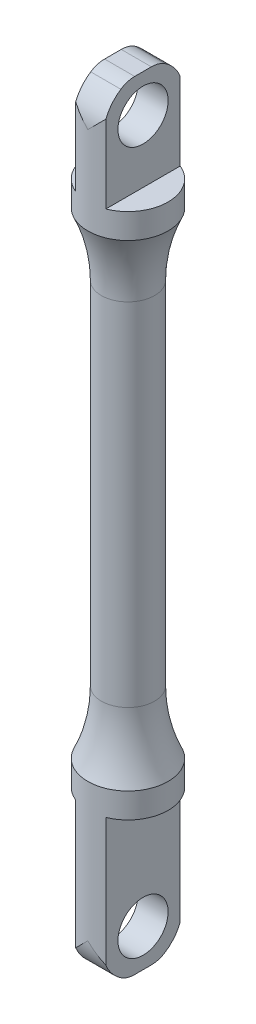
ISO-10303-21;
HEADER;
FILE_DESCRIPTION(('STEP AP214'),'2;1');
FILE_NAME('part.step','',(''),(''),'','','');
FILE_SCHEMA(('AUTOMOTIVE_DESIGN { 1 0 10303 214 1 1 1 1 }'));
ENDSEC;
DATA;
#1=APPLICATION_CONTEXT('core data for automotive mechanical design processes');
#2=APPLICATION_PROTOCOL_DEFINITION('international standard','automotive_design',2000,#1);
#3=PRODUCT_CONTEXT('',#1,'mechanical');
#4=PRODUCT('Part','Part','',(#3));
#5=PRODUCT_RELATED_PRODUCT_CATEGORY('part','',(#4));
#6=PRODUCT_DEFINITION_FORMATION('','',#4);
#7=PRODUCT_DEFINITION_CONTEXT('part definition',#1,'design');
#8=PRODUCT_DEFINITION('design','',#6,#7);
#9=PRODUCT_DEFINITION_SHAPE('','',#8);
#10=(LENGTH_UNIT() NAMED_UNIT(*) SI_UNIT(.MILLI.,.METRE.));
#11=(NAMED_UNIT(*) PLANE_ANGLE_UNIT() SI_UNIT($,.RADIAN.));
#12=(NAMED_UNIT(*) SI_UNIT($,.STERADIAN.) SOLID_ANGLE_UNIT());
#13=UNCERTAINTY_MEASURE_WITH_UNIT(LENGTH_MEASURE(1.E-05),#10,'distance_accuracy_value','');
#14=(GEOMETRIC_REPRESENTATION_CONTEXT(3) GLOBAL_UNCERTAINTY_ASSIGNED_CONTEXT((#13)) GLOBAL_UNIT_ASSIGNED_CONTEXT((#10,
#11,#12)) REPRESENTATION_CONTEXT('',''));
#15=CARTESIAN_POINT('',(0.,0.,0.));
#16=DIRECTION('',(0.,0.,1.));
#17=DIRECTION('',(1.,0.,0.));
#18=AXIS2_PLACEMENT_3D('',#15,#16,#17);
#19=CARTESIAN_POINT('',(3.00000000000001,-82.5,7.41619848709566));
#20=DIRECTION('',(-1.,0.,0.));
#21=DIRECTION('',(0.,-1.,0.));
#22=AXIS2_PLACEMENT_3D('',#19,#20,#21);
#23=PLANE('',#22);
#24=DIRECTION('',(0.,0.,1.));
#25=VECTOR('',#24,1.);
#26=CARTESIAN_POINT('',(3.00000000000001,-82.5,7.41619848709566));
#27=LINE('',#26,#25);
#28=CARTESIAN_POINT('',(3.00000000000001,-82.5,-1.65831239517774));
#29=VERTEX_POINT('',#28);
#30=CARTESIAN_POINT('',(3.00000000000001,-82.5,1.65831239517774));
#31=VERTEX_POINT('',#30);
#32=EDGE_CURVE('E311',#29,#31,#27,.T.);
#33=ORIENTED_EDGE('',*,*,#32,.F.);
#34=CARTESIAN_POINT('',(3.00000000000001,-77.5,-1.65831239517774));
#35=DIRECTION('',(-1.,0.,0.));
#36=DIRECTION('',(0.,-1.,0.));
#37=AXIS2_PLACEMENT_3D('',#34,#35,#36);
#38=CIRCLE('',#37,5.);
#39=CARTESIAN_POINT('',(3.00000000000001,-81.6666666666666,-4.42216638714064));
#40=VERTEX_POINT('',#39);
#41=EDGE_CURVE('E305',#29,#40,#38,.F.);
#42=ORIENTED_EDGE('',*,*,#41,.T.);
#43=CARTESIAN_POINT('',(3.00000000000001,-75.,0.));
#44=DIRECTION('',(-1.,0.,0.));
#45=DIRECTION('',(0.,-1.,0.));
#46=AXIS2_PLACEMENT_3D('',#43,#44,#45);
#47=CIRCLE('',#46,8.);
#48=CARTESIAN_POINT('',(3.00000000000001,-78.,-7.41619848709566));
#49=VERTEX_POINT('',#48);
#50=EDGE_CURVE('E175',#40,#49,#47,.F.);
#51=ORIENTED_EDGE('',*,*,#50,.T.);
#52=DIRECTION('',(0.,1.,0.));
#53=VECTOR('',#52,1.);
#54=CARTESIAN_POINT('',(3.00000000000001,-82.5,-7.41619848709566));
#55=LINE('',#54,#53);
#56=CARTESIAN_POINT('',(3.00000000000001,-52.5,-7.41619848709566));
#57=VERTEX_POINT('',#56);
#58=EDGE_CURVE('E174',#49,#57,#55,.T.);
#59=ORIENTED_EDGE('',*,*,#58,.T.);
#60=DIRECTION('',(0.,0.,1.));
#61=VECTOR('',#60,1.);
#62=CARTESIAN_POINT('',(3.00000000000001,-52.5,7.41619848709566));
#63=LINE('',#62,#61);
#64=CARTESIAN_POINT('',(3.00000000000001,-52.5,7.41619848709566));
#65=VERTEX_POINT('',#64);
#66=EDGE_CURVE('E323',#57,#65,#63,.T.);
#67=ORIENTED_EDGE('',*,*,#66,.T.);
#68=DIRECTION('',(0.,1.,0.));
#69=VECTOR('',#68,1.);
#70=CARTESIAN_POINT('',(3.00000000000001,-82.5,7.41619848709566));
#71=LINE('',#70,#69);
#72=CARTESIAN_POINT('',(3.00000000000001,-78.,7.41619848709566));
#73=VERTEX_POINT('',#72);
#74=EDGE_CURVE('E326',#73,#65,#71,.T.);
#75=ORIENTED_EDGE('',*,*,#74,.F.);
#76=CARTESIAN_POINT('',(3.00000000000001,-81.6666666666666,4.42216638714064));
#77=VERTEX_POINT('',#76);
#78=EDGE_CURVE('E179',#73,#77,#47,.F.);
#79=ORIENTED_EDGE('',*,*,#78,.T.);
#80=CARTESIAN_POINT('',(3.00000000000001,-77.5,1.65831239517774));
#81=DIRECTION('',(-1.,0.,0.));
#82=DIRECTION('',(0.,-1.,0.));
#83=AXIS2_PLACEMENT_3D('',#80,#81,#82);
#84=CIRCLE('',#83,5.);
#85=EDGE_CURVE('E303',#77,#31,#84,.F.);
#86=ORIENTED_EDGE('',*,*,#85,.T.);
#87=EDGE_LOOP('',(#33,#42,#51,#59,#67,#75,#79,#86));
#88=FACE_BOUND('',#87,.T.);
#89=CARTESIAN_POINT('',(3.00000000000001,-75.,0.));
#90=DIRECTION('',(-1.,0.,0.));
#91=DIRECTION('',(0.,-1.,0.));
#92=AXIS2_PLACEMENT_3D('',#89,#90,#91);
#93=CIRCLE('',#92,5.);
#94=CARTESIAN_POINT('',(3.00000000000001,-80.,0.));
#95=VERTEX_POINT('',#94);
#96=EDGE_CURVE('E294',#95,#95,#93,.T.);
#97=ORIENTED_EDGE('',*,*,#96,.T.);
#98=EDGE_LOOP('',(#97));
#99=FACE_BOUND('',#98,.T.);
#100=ADVANCED_FACE('F32',(#88,#99),#23,.F.);
#101=CARTESIAN_POINT('',(-2.99999999999999,-82.5,7.41619848709566));
#102=DIRECTION('',(1.,0.,0.));
#103=DIRECTION('',(0.,1.,0.));
#104=AXIS2_PLACEMENT_3D('',#101,#102,#103);
#105=PLANE('',#104);
#106=CARTESIAN_POINT('',(-2.99999999999999,-75.,0.));
#107=DIRECTION('',(1.,0.,0.));
#108=DIRECTION('',(0.,1.,0.));
#109=AXIS2_PLACEMENT_3D('',#106,#107,#108);
#110=CIRCLE('',#109,8.);
#111=CARTESIAN_POINT('',(-2.99999999999999,-78.,-7.41619848709566));
#112=VERTEX_POINT('',#111);
#113=CARTESIAN_POINT('',(-2.99999999999999,-81.6666666666666,-4.42216638714064));
#114=VERTEX_POINT('',#113);
#115=EDGE_CURVE('E164',#112,#114,#110,.F.);
#116=ORIENTED_EDGE('',*,*,#115,.T.);
#117=CARTESIAN_POINT('',(-2.99999999999999,-77.5,-1.65831239517774));
#118=DIRECTION('',(1.,0.,0.));
#119=DIRECTION('',(0.,1.,0.));
#120=AXIS2_PLACEMENT_3D('',#117,#118,#119);
#121=CIRCLE('',#120,5.);
#122=CARTESIAN_POINT('',(-2.99999999999999,-82.5,-1.65831239517774));
#123=VERTEX_POINT('',#122);
#124=EDGE_CURVE('E195',#114,#123,#121,.F.);
#125=ORIENTED_EDGE('',*,*,#124,.T.);
#126=DIRECTION('',(0.,0.,-1.));
#127=VECTOR('',#126,1.);
#128=CARTESIAN_POINT('',(-2.99999999999999,-82.5,7.41619848709566));
#129=LINE('',#128,#127);
#130=CARTESIAN_POINT('',(-2.99999999999999,-82.5,1.65831239517774));
#131=VERTEX_POINT('',#130);
#132=EDGE_CURVE('E315',#131,#123,#129,.T.);
#133=ORIENTED_EDGE('',*,*,#132,.F.);
#134=CARTESIAN_POINT('',(-2.99999999999999,-77.5,1.65831239517774));
#135=DIRECTION('',(1.,0.,0.));
#136=DIRECTION('',(0.,1.,0.));
#137=AXIS2_PLACEMENT_3D('',#134,#135,#136);
#138=CIRCLE('',#137,5.);
#139=CARTESIAN_POINT('',(-2.99999999999999,-81.6666666666666,4.42216638714064));
#140=VERTEX_POINT('',#139);
#141=EDGE_CURVE('E207',#131,#140,#138,.F.);
#142=ORIENTED_EDGE('',*,*,#141,.T.);
#143=CARTESIAN_POINT('',(-2.99999999999999,-78.,7.41619848709566));
#144=VERTEX_POINT('',#143);
#145=EDGE_CURVE('E184',#140,#144,#110,.F.);
#146=ORIENTED_EDGE('',*,*,#145,.T.);
#147=DIRECTION('',(0.,1.,0.));
#148=VECTOR('',#147,1.);
#149=CARTESIAN_POINT('',(-2.99999999999999,-82.5,7.41619848709566));
#150=LINE('',#149,#148);
#151=CARTESIAN_POINT('',(-2.99999999999999,-52.5,7.41619848709566));
#152=VERTEX_POINT('',#151);
#153=EDGE_CURVE('E317',#144,#152,#150,.T.);
#154=ORIENTED_EDGE('',*,*,#153,.T.);
#155=DIRECTION('',(0.,0.,-1.));
#156=VECTOR('',#155,1.);
#157=CARTESIAN_POINT('',(-2.99999999999999,-52.5,7.41619848709566));
#158=LINE('',#157,#156);
#159=CARTESIAN_POINT('',(-2.99999999999999,-52.5,-7.41619848709566));
#160=VERTEX_POINT('',#159);
#161=EDGE_CURVE('E319',#152,#160,#158,.T.);
#162=ORIENTED_EDGE('',*,*,#161,.T.);
#163=DIRECTION('',(0.,1.,0.));
#164=VECTOR('',#163,1.);
#165=CARTESIAN_POINT('',(-2.99999999999999,-82.5,-7.41619848709566));
#166=LINE('',#165,#164);
#167=EDGE_CURVE('E198',#112,#160,#166,.T.);
#168=ORIENTED_EDGE('',*,*,#167,.F.);
#169=EDGE_LOOP('',(#116,#125,#133,#142,#146,#154,#162,#168));
#170=FACE_BOUND('',#169,.T.);
#171=CARTESIAN_POINT('',(-2.99999999999999,-75.,0.));
#172=DIRECTION('',(1.,0.,0.));
#173=DIRECTION('',(0.,1.,0.));
#174=AXIS2_PLACEMENT_3D('',#171,#172,#173);
#175=CIRCLE('',#174,5.);
#176=CARTESIAN_POINT('',(-2.99999999999999,-70.,0.));
#177=VERTEX_POINT('',#176);
#178=EDGE_CURVE('E167',#177,#177,#175,.T.);
#179=ORIENTED_EDGE('',*,*,#178,.T.);
#180=EDGE_LOOP('',(#179));
#181=FACE_BOUND('',#180,.T.);
#182=ADVANCED_FACE('F192',(#170,#181),#105,.F.);
#183=CARTESIAN_POINT('',(0.,-52.5,0.));
#184=DIRECTION('',(0.,1.,0.));
#185=DIRECTION('',(-1.,0.,0.));
#186=AXIS2_PLACEMENT_3D('',#183,#184,#185);
#187=PLANE('',#186);
#188=ORIENTED_EDGE('',*,*,#161,.F.);
#189=CARTESIAN_POINT('',(0.,-52.5,0.));
#190=DIRECTION('',(0.,1.,0.));
#191=DIRECTION('',(-1.,0.,0.));
#192=AXIS2_PLACEMENT_3D('',#189,#190,#191);
#193=CIRCLE('',#192,8.);
#194=EDGE_CURVE('E288',#160,#152,#193,.T.);
#195=ORIENTED_EDGE('',*,*,#194,.F.);
#196=EDGE_LOOP('',(#188,#195));
#197=FACE_BOUND('',#196,.T.);
#198=ADVANCED_FACE('F332',(#197),#187,.F.);
#199=ORIENTED_EDGE('',*,*,#66,.F.);
#200=EDGE_CURVE('E291',#65,#57,#193,.T.);
#201=ORIENTED_EDGE('',*,*,#200,.F.);
#202=EDGE_LOOP('',(#199,#201));
#203=FACE_BOUND('',#202,.T.);
#204=ADVANCED_FACE('F329',(#203),#187,.F.);
#205=CARTESIAN_POINT('',(0.,52.5,0.));
#206=DIRECTION('',(0.,-1.,0.));
#207=DIRECTION('',(-1.,0.,0.));
#208=AXIS2_PLACEMENT_3D('',#205,#206,#207);
#209=PLANE('',#208);
#210=DIRECTION('',(0.,0.,1.));
#211=VECTOR('',#210,1.);
#212=CARTESIAN_POINT('',(-3.00000000000001,52.5,-7.41619848709566));
#213=LINE('',#212,#211);
#214=CARTESIAN_POINT('',(-3.00000000000001,52.5,-7.41619848709566));
#215=VERTEX_POINT('',#214);
#216=CARTESIAN_POINT('',(-3.00000000000001,52.5,7.41619848709566));
#217=VERTEX_POINT('',#216);
#218=EDGE_CURVE('E253',#215,#217,#213,.T.);
#219=ORIENTED_EDGE('',*,*,#218,.F.);
#220=CARTESIAN_POINT('',(0.,52.5,0.));
#221=DIRECTION('',(0.,1.,0.));
#222=DIRECTION('',(-1.,0.,0.));
#223=AXIS2_PLACEMENT_3D('',#220,#221,#222);
#224=CIRCLE('',#223,8.);
#225=EDGE_CURVE('E278',#215,#217,#224,.T.);
#226=ORIENTED_EDGE('',*,*,#225,.T.);
#227=EDGE_LOOP('',(#219,#226));
#228=FACE_BOUND('',#227,.T.);
#229=ADVANCED_FACE('F331',(#228),#209,.F.);
#230=DIRECTION('',(0.,0.,-1.));
#231=VECTOR('',#230,1.);
#232=CARTESIAN_POINT('',(2.99999999999999,52.5,-7.41619848709566));
#233=LINE('',#232,#231);
#234=CARTESIAN_POINT('',(2.99999999999999,52.5,7.41619848709566));
#235=VERTEX_POINT('',#234);
#236=CARTESIAN_POINT('',(2.99999999999999,52.5,-7.41619848709566));
#237=VERTEX_POINT('',#236);
#238=EDGE_CURVE('E258',#235,#237,#233,.T.);
#239=ORIENTED_EDGE('',*,*,#238,.F.);
#240=EDGE_CURVE('E281',#235,#237,#224,.T.);
#241=ORIENTED_EDGE('',*,*,#240,.T.);
#242=EDGE_LOOP('',(#239,#241));
#243=FACE_BOUND('',#242,.T.);
#244=ADVANCED_FACE('F338',(#243),#209,.F.);
#245=CARTESIAN_POINT('',(0.,0.,0.));
#246=DIRECTION('',(0.,1.,0.));
#247=DIRECTION('',(-1.,0.,0.));
#248=AXIS2_PLACEMENT_3D('',#245,#246,#247);
#249=CYLINDRICAL_SURFACE('',#248,8.);
#250=ORIENTED_EDGE('',*,*,#153,.F.);
#251=CARTESIAN_POINT('',(0.,-75.,0.));
#252=DIRECTION('',(-0.707106781186548,0.707106781186547,0.));
#253=DIRECTION('',(0.707106781186547,0.707106781186548,0.));
#254=AXIS2_PLACEMENT_3D('',#251,#252,#253);
#255=ELLIPSE('',#254,11.3137084989848,8.);
#256=CARTESIAN_POINT('',(0.,-75.,8.));
#257=VERTEX_POINT('',#256);
#258=EDGE_CURVE('E169',#144,#257,#255,.T.);
#259=ORIENTED_EDGE('',*,*,#258,.T.);
#260=CARTESIAN_POINT('',(0.,-75.,0.));
#261=DIRECTION('',(0.707106781186547,0.707106781186548,0.));
#262=DIRECTION('',(-0.707106781186548,0.707106781186547,0.));
#263=AXIS2_PLACEMENT_3D('',#260,#261,#262);
#264=ELLIPSE('',#263,11.3137084989848,8.);
#265=EDGE_CURVE('E177',#257,#73,#264,.T.);
#266=ORIENTED_EDGE('',*,*,#265,.T.);
#267=ORIENTED_EDGE('',*,*,#74,.T.);
#268=ORIENTED_EDGE('',*,*,#200,.T.);
#269=ORIENTED_EDGE('',*,*,#58,.F.);
#270=CARTESIAN_POINT('',(0.,-75.,-8.));
#271=VERTEX_POINT('',#270);
#272=EDGE_CURVE('E161',#49,#271,#264,.T.);
#273=ORIENTED_EDGE('',*,*,#272,.T.);
#274=EDGE_CURVE('E157',#271,#112,#255,.T.);
#275=ORIENTED_EDGE('',*,*,#274,.T.);
#276=ORIENTED_EDGE('',*,*,#167,.T.);
#277=ORIENTED_EDGE('',*,*,#194,.T.);
#278=EDGE_LOOP('',(#250,#259,#266,#267,#268,#269,#273,#275,#276,#277));
#279=FACE_BOUND('',#278,.T.);
#280=CARTESIAN_POINT('',(0.,-47.5,0.));
#281=DIRECTION('',(0.,1.,0.));
#282=DIRECTION('',(-1.,0.,0.));
#283=AXIS2_PLACEMENT_3D('',#280,#281,#282);
#284=CIRCLE('',#283,8.);
#285=CARTESIAN_POINT('',(-8.,-47.5,0.));
#286=VERTEX_POINT('',#285);
#287=EDGE_CURVE('E285',#286,#286,#284,.T.);
#288=ORIENTED_EDGE('',*,*,#287,.F.);
#289=EDGE_LOOP('',(#288));
#290=FACE_BOUND('',#289,.T.);
#291=ADVANCED_FACE('F171',(#279,#290),#249,.T.);
#292=CARTESIAN_POINT('',(0.,-35.,0.));
#293=DIRECTION('',(0.,1.,0.));
#294=DIRECTION('',(-1.,0.,0.));
#295=AXIS2_PLACEMENT_3D('',#292,#293,#294);
#296=TOROIDAL_SURFACE('',#295,35.5851851851852,30.2851851851852);
#297=CARTESIAN_POINT('',(0.,-35.,0.));
#298=DIRECTION('',(0.,1.,0.));
#299=DIRECTION('',(-1.,0.,0.));
#300=AXIS2_PLACEMENT_3D('',#297,#298,#299);
#301=CIRCLE('',#300,5.3);
#302=CARTESIAN_POINT('',(-5.3,-35.,0.));
#303=VERTEX_POINT('',#302);
#304=EDGE_CURVE('E282',#303,#303,#301,.T.);
#305=ORIENTED_EDGE('',*,*,#304,.F.);
#306=EDGE_LOOP('',(#305));
#307=FACE_BOUND('',#306,.T.);
#308=ORIENTED_EDGE('',*,*,#287,.T.);
#309=EDGE_LOOP('',(#308));
#310=FACE_BOUND('',#309,.T.);
#311=ADVANCED_FACE('F371',(#307,#310),#296,.F.);
#312=CARTESIAN_POINT('',(0.,0.,0.));
#313=DIRECTION('',(0.,1.,0.));
#314=DIRECTION('',(-1.,0.,0.));
#315=AXIS2_PLACEMENT_3D('',#312,#313,#314);
#316=CYLINDRICAL_SURFACE('',#315,5.3);
#317=ORIENTED_EDGE('',*,*,#304,.T.);
#318=EDGE_LOOP('',(#317));
#319=FACE_BOUND('',#318,.T.);
#320=CARTESIAN_POINT('',(0.,35.,0.));
#321=DIRECTION('',(0.,1.,0.));
#322=DIRECTION('',(-1.,0.,0.));
#323=AXIS2_PLACEMENT_3D('',#320,#321,#322);
#324=CIRCLE('',#323,5.3);
#325=CARTESIAN_POINT('',(-5.30000000000001,35.,0.));
#326=VERTEX_POINT('',#325);
#327=EDGE_CURVE('E272',#326,#326,#324,.T.);
#328=ORIENTED_EDGE('',*,*,#327,.F.);
#329=EDGE_LOOP('',(#328));
#330=FACE_BOUND('',#329,.T.);
#331=ADVANCED_FACE('F366',(#319,#330),#316,.T.);
#332=CARTESIAN_POINT('',(0.,0.,0.));
#333=DIRECTION('',(0.,-1.,0.));
#334=DIRECTION('',(-1.,0.,0.));
#335=AXIS2_PLACEMENT_3D('',#332,#333,#334);
#336=CYLINDRICAL_SURFACE('',#335,8.);
#337=DIRECTION('',(0.,-1.,0.));
#338=VECTOR('',#337,1.);
#339=CARTESIAN_POINT('',(-3.00000000000001,72.5,-7.41619848709566));
#340=LINE('',#339,#338);
#341=CARTESIAN_POINT('',(-3.00000000000001,68.,-7.41619848709566));
#342=VERTEX_POINT('',#341);
#343=EDGE_CURVE('E266',#342,#215,#340,.T.);
#344=ORIENTED_EDGE('',*,*,#343,.F.);
#345=CARTESIAN_POINT('',(0.,65.,0.));
#346=DIRECTION('',(-0.707106781186547,-0.707106781186548,0.));
#347=DIRECTION('',(0.707106781186548,-0.707106781186547,0.));
#348=AXIS2_PLACEMENT_3D('',#345,#346,#347);
#349=ELLIPSE('',#348,11.3137084989848,8.);
#350=CARTESIAN_POINT('',(0.,65.,-8.));
#351=VERTEX_POINT('',#350);
#352=EDGE_CURVE('E237',#342,#351,#349,.T.);
#353=ORIENTED_EDGE('',*,*,#352,.T.);
#354=CARTESIAN_POINT('',(0.,65.,0.));
#355=DIRECTION('',(0.707106781186548,-0.707106781186547,0.));
#356=DIRECTION('',(-0.707106781186547,-0.707106781186548,0.));
#357=AXIS2_PLACEMENT_3D('',#354,#355,#356);
#358=ELLIPSE('',#357,11.3137084989848,8.);
#359=CARTESIAN_POINT('',(2.99999999999999,68.,-7.41619848709566));
#360=VERTEX_POINT('',#359);
#361=EDGE_CURVE('E389',#351,#360,#358,.T.);
#362=ORIENTED_EDGE('',*,*,#361,.T.);
#363=DIRECTION('',(0.,-1.,0.));
#364=VECTOR('',#363,1.);
#365=CARTESIAN_POINT('',(2.99999999999999,72.5,-7.41619848709566));
#366=LINE('',#365,#364);
#367=EDGE_CURVE('E268',#360,#237,#366,.T.);
#368=ORIENTED_EDGE('',*,*,#367,.T.);
#369=ORIENTED_EDGE('',*,*,#240,.F.);
#370=DIRECTION('',(0.,-1.,0.));
#371=VECTOR('',#370,1.);
#372=CARTESIAN_POINT('',(2.99999999999999,72.5,7.41619848709566));
#373=LINE('',#372,#371);
#374=CARTESIAN_POINT('',(2.99999999999999,68.,7.41619848709566));
#375=VERTEX_POINT('',#374);
#376=EDGE_CURVE('E270',#375,#235,#373,.T.);
#377=ORIENTED_EDGE('',*,*,#376,.F.);
#378=CARTESIAN_POINT('',(0.,65.,8.));
#379=VERTEX_POINT('',#378);
#380=EDGE_CURVE('E391',#375,#379,#358,.T.);
#381=ORIENTED_EDGE('',*,*,#380,.T.);
#382=CARTESIAN_POINT('',(-3.00000000000001,68.,7.41619848709566));
#383=VERTEX_POINT('',#382);
#384=EDGE_CURVE('E240',#379,#383,#349,.T.);
#385=ORIENTED_EDGE('',*,*,#384,.T.);
#386=DIRECTION('',(0.,-1.,0.));
#387=VECTOR('',#386,1.);
#388=CARTESIAN_POINT('',(-3.00000000000001,72.5,7.41619848709566));
#389=LINE('',#388,#387);
#390=EDGE_CURVE('E255',#383,#217,#389,.T.);
#391=ORIENTED_EDGE('',*,*,#390,.T.);
#392=ORIENTED_EDGE('',*,*,#225,.F.);
#393=EDGE_LOOP('',(#344,#353,#362,#368,#369,#377,#381,#385,#391,#392));
#394=FACE_BOUND('',#393,.T.);
#395=CARTESIAN_POINT('',(0.,47.5,0.));
#396=DIRECTION('',(0.,1.,0.));
#397=DIRECTION('',(-1.,0.,0.));
#398=AXIS2_PLACEMENT_3D('',#395,#396,#397);
#399=CIRCLE('',#398,8.);
#400=CARTESIAN_POINT('',(-8.00000000000001,47.5,0.));
#401=VERTEX_POINT('',#400);
#402=EDGE_CURVE('E275',#401,#401,#399,.T.);
#403=ORIENTED_EDGE('',*,*,#402,.T.);
#404=EDGE_LOOP('',(#403));
#405=FACE_BOUND('',#404,.T.);
#406=ADVANCED_FACE('F363',(#394,#405),#336,.T.);
#407=CARTESIAN_POINT('',(0.,35.,0.));
#408=DIRECTION('',(0.,-1.,0.));
#409=DIRECTION('',(-1.,0.,0.));
#410=AXIS2_PLACEMENT_3D('',#407,#408,#409);
#411=TOROIDAL_SURFACE('',#410,35.5851851851852,30.2851851851852);
#412=ORIENTED_EDGE('',*,*,#327,.T.);
#413=EDGE_LOOP('',(#412));
#414=FACE_BOUND('',#413,.T.);
#415=ORIENTED_EDGE('',*,*,#402,.F.);
#416=EDGE_LOOP('',(#415));
#417=FACE_BOUND('',#416,.T.);
#418=ADVANCED_FACE('F359',(#414,#417),#411,.F.);
#419=CARTESIAN_POINT('',(2.99999999999999,72.5,-7.41619848709566));
#420=DIRECTION('',(-1.,0.,0.));
#421=DIRECTION('',(0.,-1.,0.));
#422=AXIS2_PLACEMENT_3D('',#419,#420,#421);
#423=PLANE('',#422);
#424=CARTESIAN_POINT('',(2.99999999999999,65.,0.));
#425=DIRECTION('',(-1.,0.,0.));
#426=DIRECTION('',(0.,-1.,0.));
#427=AXIS2_PLACEMENT_3D('',#424,#425,#426);
#428=CIRCLE('',#427,5.);
#429=CARTESIAN_POINT('',(2.99999999999999,60.,0.));
#430=VERTEX_POINT('',#429);
#431=EDGE_CURVE('E298',#430,#430,#428,.T.);
#432=ORIENTED_EDGE('',*,*,#431,.T.);
#433=EDGE_LOOP('',(#432));
#434=FACE_BOUND('',#433,.T.);
#435=CARTESIAN_POINT('',(2.99999999999999,65.,0.));
#436=DIRECTION('',(-1.,0.,0.));
#437=DIRECTION('',(0.,-1.,0.));
#438=AXIS2_PLACEMENT_3D('',#435,#436,#437);
#439=CIRCLE('',#438,8.);
#440=CARTESIAN_POINT('',(2.99999999999999,71.6666666666666,-4.42216638714058));
#441=VERTEX_POINT('',#440);
#442=EDGE_CURVE('E239',#360,#441,#439,.F.);
#443=ORIENTED_EDGE('',*,*,#442,.T.);
#444=CARTESIAN_POINT('',(2.99999999999999,67.5,-1.65831239517772));
#445=DIRECTION('',(-1.,0.,0.));
#446=DIRECTION('',(0.,-1.,0.));
#447=AXIS2_PLACEMENT_3D('',#444,#445,#446);
#448=CIRCLE('',#447,5.);
#449=CARTESIAN_POINT('',(2.99999999999999,72.5,-1.65831239517772));
#450=VERTEX_POINT('',#449);
#451=EDGE_CURVE('E218',#441,#450,#448,.F.);
#452=ORIENTED_EDGE('',*,*,#451,.T.);
#453=DIRECTION('',(0.,0.,-1.));
#454=VECTOR('',#453,1.);
#455=CARTESIAN_POINT('',(2.99999999999999,72.5,-7.41619848709566));
#456=LINE('',#455,#454);
#457=CARTESIAN_POINT('',(2.99999999999999,72.5,1.65831239517771));
#458=VERTEX_POINT('',#457);
#459=EDGE_CURVE('E248',#458,#450,#456,.T.);
#460=ORIENTED_EDGE('',*,*,#459,.F.);
#461=CARTESIAN_POINT('',(2.99999999999999,67.5,1.65831239517772));
#462=DIRECTION('',(-1.,0.,0.));
#463=DIRECTION('',(0.,-1.,0.));
#464=AXIS2_PLACEMENT_3D('',#461,#462,#463);
#465=CIRCLE('',#464,5.);
#466=CARTESIAN_POINT('',(2.99999999999999,71.6666666666666,4.42216638714058));
#467=VERTEX_POINT('',#466);
#468=EDGE_CURVE('E216',#458,#467,#465,.F.);
#469=ORIENTED_EDGE('',*,*,#468,.T.);
#470=EDGE_CURVE('E394',#467,#375,#439,.F.);
#471=ORIENTED_EDGE('',*,*,#470,.T.);
#472=ORIENTED_EDGE('',*,*,#376,.T.);
#473=ORIENTED_EDGE('',*,*,#238,.T.);
#474=ORIENTED_EDGE('',*,*,#367,.F.);
#475=EDGE_LOOP('',(#443,#452,#460,#469,#471,#472,#473,#474));
#476=FACE_BOUND('',#475,.T.);
#477=ADVANCED_FACE('F247',(#434,#476),#423,.F.);
#478=CARTESIAN_POINT('',(-3.00000000000001,72.5,-7.41619848709566));
#479=DIRECTION('',(1.,0.,0.));
#480=DIRECTION('',(0.,1.,0.));
#481=AXIS2_PLACEMENT_3D('',#478,#479,#480);
#482=PLANE('',#481);
#483=CARTESIAN_POINT('',(-3.00000000000001,65.,0.));
#484=DIRECTION('',(1.,0.,0.));
#485=DIRECTION('',(0.,1.,0.));
#486=AXIS2_PLACEMENT_3D('',#483,#484,#485);
#487=CIRCLE('',#486,5.);
#488=CARTESIAN_POINT('',(-3.00000000000001,70.,0.));
#489=VERTEX_POINT('',#488);
#490=EDGE_CURVE('E295',#489,#489,#487,.T.);
#491=ORIENTED_EDGE('',*,*,#490,.T.);
#492=EDGE_LOOP('',(#491));
#493=FACE_BOUND('',#492,.T.);
#494=DIRECTION('',(0.,0.,1.));
#495=VECTOR('',#494,1.);
#496=CARTESIAN_POINT('',(-3.00000000000001,72.5,-7.41619848709566));
#497=LINE('',#496,#495);
#498=CARTESIAN_POINT('',(-3.00000000000001,72.5,-1.65831239517772));
#499=VERTEX_POINT('',#498);
#500=CARTESIAN_POINT('',(-3.00000000000001,72.5,1.65831239517771));
#501=VERTEX_POINT('',#500);
#502=EDGE_CURVE('E229',#499,#501,#497,.T.);
#503=ORIENTED_EDGE('',*,*,#502,.F.);
#504=CARTESIAN_POINT('',(-3.00000000000001,67.5,-1.65831239517772));
#505=DIRECTION('',(1.,0.,0.));
#506=DIRECTION('',(0.,1.,0.));
#507=AXIS2_PLACEMENT_3D('',#504,#505,#506);
#508=CIRCLE('',#507,5.);
#509=CARTESIAN_POINT('',(-3.00000000000001,71.6666666666666,-4.42216638714058));
#510=VERTEX_POINT('',#509);
#511=EDGE_CURVE('E40',#499,#510,#508,.F.);
#512=ORIENTED_EDGE('',*,*,#511,.T.);
#513=CARTESIAN_POINT('',(-3.00000000000001,65.,0.));
#514=DIRECTION('',(1.,0.,0.));
#515=DIRECTION('',(0.,1.,0.));
#516=AXIS2_PLACEMENT_3D('',#513,#514,#515);
#517=CIRCLE('',#516,8.);
#518=EDGE_CURVE('E227',#510,#342,#517,.F.);
#519=ORIENTED_EDGE('',*,*,#518,.T.);
#520=ORIENTED_EDGE('',*,*,#343,.T.);
#521=ORIENTED_EDGE('',*,*,#218,.T.);
#522=ORIENTED_EDGE('',*,*,#390,.F.);
#523=CARTESIAN_POINT('',(-3.00000000000001,71.6666666666666,4.42216638714058));
#524=VERTEX_POINT('',#523);
#525=EDGE_CURVE('E242',#383,#524,#517,.F.);
#526=ORIENTED_EDGE('',*,*,#525,.T.);
#527=CARTESIAN_POINT('',(-3.00000000000001,67.5,1.65831239517772));
#528=DIRECTION('',(1.,0.,0.));
#529=DIRECTION('',(0.,1.,0.));
#530=AXIS2_PLACEMENT_3D('',#527,#528,#529);
#531=CIRCLE('',#530,5.);
#532=EDGE_CURVE('E47',#524,#501,#531,.F.);
#533=ORIENTED_EDGE('',*,*,#532,.T.);
#534=EDGE_LOOP('',(#503,#512,#519,#520,#521,#522,#526,#533));
#535=FACE_BOUND('',#534,.T.);
#536=ADVANCED_FACE('F226',(#493,#535),#482,.F.);
#537=CARTESIAN_POINT('',(0.,72.5,0.));
#538=DIRECTION('',(0.,1.,0.));
#539=DIRECTION('',(-1.,0.,0.));
#540=AXIS2_PLACEMENT_3D('',#537,#538,#539);
#541=PLANE('',#540);
#542=ORIENTED_EDGE('',*,*,#459,.T.);
#543=DIRECTION('',(1.,0.,0.));
#544=VECTOR('',#543,1.);
#545=CARTESIAN_POINT('',(-3.00000000000001,72.5,-1.65831239517772));
#546=LINE('',#545,#544);
#547=EDGE_CURVE('E222',#450,#499,#546,.F.);
#548=ORIENTED_EDGE('',*,*,#547,.T.);
#549=ORIENTED_EDGE('',*,*,#502,.T.);
#550=DIRECTION('',(1.,0.,0.));
#551=VECTOR('',#550,1.);
#552=CARTESIAN_POINT('',(2.99999999999999,72.5,1.65831239517772));
#553=LINE('',#552,#551);
#554=EDGE_CURVE('E220',#501,#458,#553,.T.);
#555=ORIENTED_EDGE('',*,*,#554,.T.);
#556=EDGE_LOOP('',(#542,#548,#549,#555));
#557=FACE_BOUND('',#556,.T.);
#558=ADVANCED_FACE('F252',(#557),#541,.T.);
#559=CARTESIAN_POINT('',(0.,-82.5,0.));
#560=DIRECTION('',(0.,1.,0.));
#561=DIRECTION('',(-1.,0.,0.));
#562=AXIS2_PLACEMENT_3D('',#559,#560,#561);
#563=PLANE('',#562);
#564=ORIENTED_EDGE('',*,*,#132,.T.);
#565=DIRECTION('',(-1.,0.,0.));
#566=VECTOR('',#565,1.);
#567=CARTESIAN_POINT('',(0.,-82.5,-1.65831239517774));
#568=LINE('',#567,#566);
#569=EDGE_CURVE('E205',#123,#29,#568,.F.);
#570=ORIENTED_EDGE('',*,*,#569,.T.);
#571=ORIENTED_EDGE('',*,*,#32,.T.);
#572=DIRECTION('',(-1.,0.,0.));
#573=VECTOR('',#572,1.);
#574=CARTESIAN_POINT('',(0.,-82.5,1.65831239517774));
#575=LINE('',#574,#573);
#576=EDGE_CURVE('E299',#31,#131,#575,.T.);
#577=ORIENTED_EDGE('',*,*,#576,.T.);
#578=EDGE_LOOP('',(#564,#570,#571,#577));
#579=FACE_BOUND('',#578,.T.);
#580=ADVANCED_FACE('F313',(#579),#563,.F.);
#581=CARTESIAN_POINT('',(8.00000000000003,-75.,0.));
#582=DIRECTION('',(-1.,0.,0.));
#583=DIRECTION('',(0.,-1.,0.));
#584=AXIS2_PLACEMENT_3D('',#581,#582,#583);
#585=CYLINDRICAL_SURFACE('',#584,8.);
#586=ORIENTED_EDGE('',*,*,#145,.F.);
#587=DIRECTION('',(-1.,0.,0.));
#588=VECTOR('',#587,1.);
#589=CARTESIAN_POINT('',(8.00000000000003,-81.6666666666666,4.42216638714064));
#590=LINE('',#589,#588);
#591=EDGE_CURVE('E206',#140,#77,#590,.F.);
#592=ORIENTED_EDGE('',*,*,#591,.T.);
#593=ORIENTED_EDGE('',*,*,#78,.F.);
#594=ORIENTED_EDGE('',*,*,#265,.F.);
#595=ORIENTED_EDGE('',*,*,#258,.F.);
#596=EDGE_LOOP('',(#586,#592,#593,#594,#595));
#597=FACE_BOUND('',#596,.T.);
#598=ADVANCED_FACE('F413',(#597),#585,.T.);
#599=ORIENTED_EDGE('',*,*,#50,.F.);
#600=DIRECTION('',(-1.,0.,0.));
#601=VECTOR('',#600,1.);
#602=CARTESIAN_POINT('',(8.00000000000003,-81.6666666666666,-4.42216638714064));
#603=LINE('',#602,#601);
#604=EDGE_CURVE('E203',#40,#114,#603,.T.);
#605=ORIENTED_EDGE('',*,*,#604,.T.);
#606=ORIENTED_EDGE('',*,*,#115,.F.);
#607=ORIENTED_EDGE('',*,*,#274,.F.);
#608=ORIENTED_EDGE('',*,*,#272,.F.);
#609=EDGE_LOOP('',(#599,#605,#606,#607,#608));
#610=FACE_BOUND('',#609,.T.);
#611=ADVANCED_FACE('F160',(#610),#585,.T.);
#612=CARTESIAN_POINT('',(8.00000000000003,-75.,0.));
#613=DIRECTION('',(-1.,0.,0.));
#614=DIRECTION('',(0.,-1.,0.));
#615=AXIS2_PLACEMENT_3D('',#612,#613,#614);
#616=CYLINDRICAL_SURFACE('',#615,5.);
#617=ORIENTED_EDGE('',*,*,#178,.F.);
#618=EDGE_LOOP('',(#617));
#619=FACE_BOUND('',#618,.T.);
#620=ORIENTED_EDGE('',*,*,#96,.F.);
#621=EDGE_LOOP('',(#620));
#622=FACE_BOUND('',#621,.T.);
#623=ADVANCED_FACE('F402',(#619,#622),#616,.F.);
#624=CARTESIAN_POINT('',(8.00000000000001,65.,0.));
#625=DIRECTION('',(-1.,0.,0.));
#626=DIRECTION('',(0.,-1.,0.));
#627=AXIS2_PLACEMENT_3D('',#624,#625,#626);
#628=CYLINDRICAL_SURFACE('',#627,8.);
#629=ORIENTED_EDGE('',*,*,#470,.F.);
#630=DIRECTION('',(-1.,0.,0.));
#631=VECTOR('',#630,1.);
#632=CARTESIAN_POINT('',(8.00000000000001,71.6666666666666,4.42216638714058));
#633=LINE('',#632,#631);
#634=EDGE_CURVE('E11',#467,#524,#633,.T.);
#635=ORIENTED_EDGE('',*,*,#634,.T.);
#636=ORIENTED_EDGE('',*,*,#525,.F.);
#637=ORIENTED_EDGE('',*,*,#384,.F.);
#638=ORIENTED_EDGE('',*,*,#380,.F.);
#639=EDGE_LOOP('',(#629,#635,#636,#637,#638));
#640=FACE_BOUND('',#639,.T.);
#641=ADVANCED_FACE('F404',(#640),#628,.T.);
#642=ORIENTED_EDGE('',*,*,#518,.F.);
#643=DIRECTION('',(-1.,0.,0.));
#644=VECTOR('',#643,1.);
#645=CARTESIAN_POINT('',(8.00000000000001,71.6666666666666,-4.42216638714058));
#646=LINE('',#645,#644);
#647=EDGE_CURVE('E209',#510,#441,#646,.F.);
#648=ORIENTED_EDGE('',*,*,#647,.T.);
#649=ORIENTED_EDGE('',*,*,#442,.F.);
#650=ORIENTED_EDGE('',*,*,#361,.F.);
#651=ORIENTED_EDGE('',*,*,#352,.F.);
#652=EDGE_LOOP('',(#642,#648,#649,#650,#651));
#653=FACE_BOUND('',#652,.T.);
#654=ADVANCED_FACE('F234',(#653),#628,.T.);
#655=CARTESIAN_POINT('',(8.00000000000001,65.,0.));
#656=DIRECTION('',(-1.,0.,0.));
#657=DIRECTION('',(0.,-1.,0.));
#658=AXIS2_PLACEMENT_3D('',#655,#656,#657);
#659=CYLINDRICAL_SURFACE('',#658,5.);
#660=ORIENTED_EDGE('',*,*,#490,.F.);
#661=EDGE_LOOP('',(#660));
#662=FACE_BOUND('',#661,.T.);
#663=ORIENTED_EDGE('',*,*,#431,.F.);
#664=EDGE_LOOP('',(#663));
#665=FACE_BOUND('',#664,.T.);
#666=ADVANCED_FACE('F418',(#662,#665),#659,.F.);
#667=CARTESIAN_POINT('',(8.00000000000003,-77.5,-1.65831239517774));
#668=DIRECTION('',(-1.,0.,0.));
#669=DIRECTION('',(0.,-1.,0.));
#670=AXIS2_PLACEMENT_3D('',#667,#668,#669);
#671=CYLINDRICAL_SURFACE('',#670,5.);
#672=ORIENTED_EDGE('',*,*,#124,.F.);
#673=ORIENTED_EDGE('',*,*,#604,.F.);
#674=ORIENTED_EDGE('',*,*,#41,.F.);
#675=ORIENTED_EDGE('',*,*,#569,.F.);
#676=EDGE_LOOP('',(#672,#673,#674,#675));
#677=FACE_BOUND('',#676,.T.);
#678=ADVANCED_FACE('F202',(#677),#671,.T.);
#679=CARTESIAN_POINT('',(8.00000000000003,-77.5,1.65831239517774));
#680=DIRECTION('',(-1.,0.,0.));
#681=DIRECTION('',(0.,-1.,0.));
#682=AXIS2_PLACEMENT_3D('',#679,#680,#681);
#683=CYLINDRICAL_SURFACE('',#682,5.);
#684=ORIENTED_EDGE('',*,*,#85,.F.);
#685=ORIENTED_EDGE('',*,*,#591,.F.);
#686=ORIENTED_EDGE('',*,*,#141,.F.);
#687=ORIENTED_EDGE('',*,*,#576,.F.);
#688=EDGE_LOOP('',(#684,#685,#686,#687));
#689=FACE_BOUND('',#688,.T.);
#690=ADVANCED_FACE('F430',(#689),#683,.T.);
#691=CARTESIAN_POINT('',(8.00000000000001,67.5,-1.65831239517772));
#692=DIRECTION('',(-1.,0.,0.));
#693=DIRECTION('',(0.,-1.,0.));
#694=AXIS2_PLACEMENT_3D('',#691,#692,#693);
#695=CYLINDRICAL_SURFACE('',#694,5.);
#696=ORIENTED_EDGE('',*,*,#511,.F.);
#697=ORIENTED_EDGE('',*,*,#547,.F.);
#698=ORIENTED_EDGE('',*,*,#451,.F.);
#699=ORIENTED_EDGE('',*,*,#647,.F.);
#700=EDGE_LOOP('',(#696,#697,#698,#699));
#701=FACE_BOUND('',#700,.T.);
#702=ADVANCED_FACE('F243',(#701),#695,.T.);
#703=CARTESIAN_POINT('',(8.00000000000001,67.5,1.65831239517772));
#704=DIRECTION('',(-1.,0.,0.));
#705=DIRECTION('',(0.,-1.,0.));
#706=AXIS2_PLACEMENT_3D('',#703,#704,#705);
#707=CYLINDRICAL_SURFACE('',#706,5.);
#708=ORIENTED_EDGE('',*,*,#468,.F.);
#709=ORIENTED_EDGE('',*,*,#554,.F.);
#710=ORIENTED_EDGE('',*,*,#532,.F.);
#711=ORIENTED_EDGE('',*,*,#634,.F.);
#712=EDGE_LOOP('',(#708,#709,#710,#711));
#713=FACE_BOUND('',#712,.T.);
#714=ADVANCED_FACE('F34',(#713),#707,.T.);
#715=CLOSED_SHELL('',(#100,#182,#198,#204,#229,#244,#291,#311,#331,#406,#418,#477,#536,#558,
#580,#598,#611,#623,#641,#654,#666,#678,#690,#702,#714));
#716=MANIFOLD_SOLID_BREP('B2',#715);
#717=ADVANCED_BREP_SHAPE_REPRESENTATION('',(#18,#716),#14);
#718=SHAPE_DEFINITION_REPRESENTATION(#9,#717);
ENDSEC;
END-ISO-10303-21;
